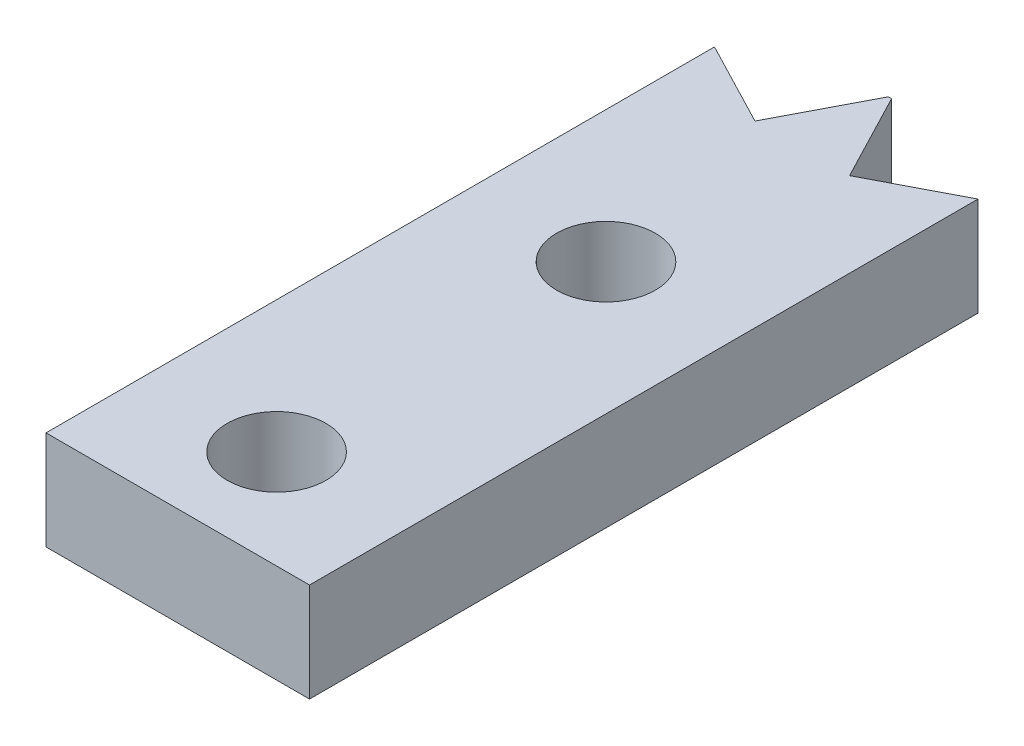
ISO-10303-21;
HEADER;
FILE_DESCRIPTION(('STEP AP214'),'2;1');
FILE_NAME('part.step','',(''),(''),'','','');
FILE_SCHEMA(('AUTOMOTIVE_DESIGN { 1 0 10303 214 1 1 1 1 }'));
ENDSEC;
DATA;
#1=APPLICATION_CONTEXT('core data for automotive mechanical design processes');
#2=APPLICATION_PROTOCOL_DEFINITION('international standard','automotive_design',2000,#1);
#3=PRODUCT_CONTEXT('',#1,'mechanical');
#4=PRODUCT('Part','Part','',(#3));
#5=PRODUCT_RELATED_PRODUCT_CATEGORY('part','',(#4));
#6=PRODUCT_DEFINITION_FORMATION('','',#4);
#7=PRODUCT_DEFINITION_CONTEXT('part definition',#1,'design');
#8=PRODUCT_DEFINITION('design','',#6,#7);
#9=PRODUCT_DEFINITION_SHAPE('','',#8);
#10=(LENGTH_UNIT() NAMED_UNIT(*) SI_UNIT(.MILLI.,.METRE.));
#11=(NAMED_UNIT(*) PLANE_ANGLE_UNIT() SI_UNIT($,.RADIAN.));
#12=(NAMED_UNIT(*) SI_UNIT($,.STERADIAN.) SOLID_ANGLE_UNIT());
#13=UNCERTAINTY_MEASURE_WITH_UNIT(LENGTH_MEASURE(1.E-05),#10,'distance_accuracy_value','');
#14=(GEOMETRIC_REPRESENTATION_CONTEXT(3) GLOBAL_UNCERTAINTY_ASSIGNED_CONTEXT((#13)) GLOBAL_UNIT_ASSIGNED_CONTEXT((#10,
#11,#12)) REPRESENTATION_CONTEXT('',''));
#15=CARTESIAN_POINT('',(0.,0.,0.));
#16=DIRECTION('',(0.,0.,1.));
#17=DIRECTION('',(1.,0.,0.));
#18=AXIS2_PLACEMENT_3D('',#15,#16,#17);
#19=CARTESIAN_POINT('',(0.,3.,0.));
#20=DIRECTION('',(0.,1.,0.));
#21=DIRECTION('',(0.,0.,1.));
#22=AXIS2_PLACEMENT_3D('',#19,#20,#21);
#23=PLANE('',#22);
#24=CARTESIAN_POINT('',(5.25372166076024,3.,-14.38));
#25=DIRECTION('',(0.,1.,0.));
#26=DIRECTION('',(0.,0.,1.));
#27=AXIS2_PLACEMENT_3D('',#24,#25,#26);
#28=CIRCLE('',#27,1.5);
#29=CARTESIAN_POINT('',(5.25372166076024,3.,-12.88));
#30=VERTEX_POINT('',#29);
#31=EDGE_CURVE('E115',#30,#30,#28,.T.);
#32=ORIENTED_EDGE('',*,*,#31,.F.);
#33=EDGE_LOOP('',(#32));
#34=FACE_BOUND('',#33,.T.);
#35=CARTESIAN_POINT('',(5.25372166076024,3.,-4.38));
#36=DIRECTION('',(0.,1.,0.));
#37=DIRECTION('',(0.,0.,1.));
#38=AXIS2_PLACEMENT_3D('',#35,#36,#37);
#39=CIRCLE('',#38,1.5);
#40=CARTESIAN_POINT('',(5.25372166076024,3.,-2.88));
#41=VERTEX_POINT('',#40);
#42=EDGE_CURVE('E145',#41,#41,#39,.T.);
#43=ORIENTED_EDGE('',*,*,#42,.F.);
#44=EDGE_LOOP('',(#43));
#45=FACE_BOUND('',#44,.T.);
#46=DIRECTION('',(0.,0.,-1.));
#47=VECTOR('',#46,1.);
#48=CARTESIAN_POINT('',(1.25372166076023,3.,0.));
#49=LINE('',#48,#47);
#50=CARTESIAN_POINT('',(1.25372166076023,3.,-1.38));
#51=VERTEX_POINT('',#50);
#52=CARTESIAN_POINT('',(1.25372166076023,3.,-21.6742955194717));
#53=VERTEX_POINT('',#52);
#54=EDGE_CURVE('E112',#51,#53,#49,.T.);
#55=ORIENTED_EDGE('',*,*,#54,.F.);
#56=DIRECTION('',(-1.,0.,0.));
#57=VECTOR('',#56,1.);
#58=CARTESIAN_POINT('',(1.25372166076023,3.,-1.38));
#59=LINE('',#58,#57);
#60=CARTESIAN_POINT('',(9.25372166076023,3.,-1.38));
#61=VERTEX_POINT('',#60);
#62=EDGE_CURVE('E49',#61,#51,#59,.T.);
#63=ORIENTED_EDGE('',*,*,#62,.F.);
#64=DIRECTION('',(0.,0.,1.));
#65=VECTOR('',#64,1.);
#66=CARTESIAN_POINT('',(9.25372166076023,3.,0.));
#67=LINE('',#66,#65);
#68=CARTESIAN_POINT('',(9.25372166076023,3.,-21.6742955194716));
#69=VERTEX_POINT('',#68);
#70=EDGE_CURVE('E185',#69,#61,#67,.T.);
#71=ORIENTED_EDGE('',*,*,#70,.F.);
#72=DIRECTION('',(-0.887010833178221,0.,0.461748613235035));
#73=VECTOR('',#72,1.);
#74=CARTESIAN_POINT('',(-6.90426925785102,3.,-13.2629778441283));
#75=LINE('',#74,#73);
#76=CARTESIAN_POINT('',(6.68896750046542,3.,-20.3391690108566));
#77=VERTEX_POINT('',#76);
#78=EDGE_CURVE('E166',#69,#77,#75,.T.);
#79=ORIENTED_EDGE('',*,*,#78,.T.);
#80=DIRECTION('',(0.461748613235035,0.,0.887010833178221));
#81=VECTOR('',#80,1.);
#82=CARTESIAN_POINT('',(13.5932367583164,3.,-7.07619116672839));
#83=LINE('',#82,#81);
#84=CARTESIAN_POINT('',(5.30372166076032,3.,-23.0002015103913));
#85=VERTEX_POINT('',#84);
#86=EDGE_CURVE('E139',#85,#77,#83,.T.);
#87=ORIENTED_EDGE('',*,*,#86,.F.);
#88=DIRECTION('',(1.,0.,0.));
#89=VECTOR('',#88,1.);
#90=CARTESIAN_POINT('',(0.,3.,-23.0002015103913));
#91=LINE('',#90,#89);
#92=CARTESIAN_POINT('',(5.20372166076032,3.,-23.0002015103913));
#93=VERTEX_POINT('',#92);
#94=EDGE_CURVE('E135',#93,#85,#91,.T.);
#95=ORIENTED_EDGE('',*,*,#94,.F.);
#96=DIRECTION('',(-0.461748613235035,0.,0.887010833178221));
#97=VECTOR('',#96,1.);
#98=CARTESIAN_POINT('',(-5.32610414979693,3.,-2.77259432819121));
#99=LINE('',#98,#97);
#100=CARTESIAN_POINT('',(3.81847582105521,3.,-20.3391690108567));
#101=VERTEX_POINT('',#100);
#102=EDGE_CURVE('E161',#93,#101,#99,.T.);
#103=ORIENTED_EDGE('',*,*,#102,.T.);
#104=DIRECTION('',(0.887010833178221,0.,0.461748613235035));
#105=VECTOR('',#104,1.);
#106=CARTESIAN_POINT('',(9.14457997085215,3.,-17.5665746826654));
#107=LINE('',#106,#105);
#108=EDGE_CURVE('E164',#53,#101,#107,.T.);
#109=ORIENTED_EDGE('',*,*,#108,.F.);
#110=EDGE_LOOP('',(#55,#63,#71,#79,#87,#95,#103,#109));
#111=FACE_BOUND('',#110,.T.);
#112=ADVANCED_FACE('F34',(#34,#45,#111),#23,.T.);
#113=CARTESIAN_POINT('',(0.,0.,0.));
#114=DIRECTION('',(0.,1.,0.));
#115=DIRECTION('',(0.,0.,1.));
#116=AXIS2_PLACEMENT_3D('',#113,#114,#115);
#117=PLANE('',#116);
#118=CARTESIAN_POINT('',(5.25372166076024,0.,-4.38));
#119=DIRECTION('',(0.,1.,0.));
#120=DIRECTION('',(0.,0.,1.));
#121=AXIS2_PLACEMENT_3D('',#118,#119,#120);
#122=CIRCLE('',#121,1.5);
#123=CARTESIAN_POINT('',(5.25372166076024,0.,-2.88));
#124=VERTEX_POINT('',#123);
#125=EDGE_CURVE('E149',#124,#124,#122,.T.);
#126=ORIENTED_EDGE('',*,*,#125,.T.);
#127=EDGE_LOOP('',(#126));
#128=FACE_BOUND('',#127,.T.);
#129=CARTESIAN_POINT('',(5.25372166076024,0.,-14.38));
#130=DIRECTION('',(0.,1.,0.));
#131=DIRECTION('',(0.,0.,1.));
#132=AXIS2_PLACEMENT_3D('',#129,#130,#131);
#133=CIRCLE('',#132,1.5);
#134=CARTESIAN_POINT('',(5.25372166076024,0.,-12.88));
#135=VERTEX_POINT('',#134);
#136=EDGE_CURVE('E143',#135,#135,#133,.T.);
#137=ORIENTED_EDGE('',*,*,#136,.T.);
#138=EDGE_LOOP('',(#137));
#139=FACE_BOUND('',#138,.T.);
#140=DIRECTION('',(1.,0.,0.));
#141=VECTOR('',#140,1.);
#142=CARTESIAN_POINT('',(1.25372166076023,0.,-1.38));
#143=LINE('',#142,#141);
#144=CARTESIAN_POINT('',(1.25372166076023,0.,-1.38));
#145=VERTEX_POINT('',#144);
#146=CARTESIAN_POINT('',(9.25372166076023,0.,-1.38));
#147=VERTEX_POINT('',#146);
#148=EDGE_CURVE('E97',#145,#147,#143,.T.);
#149=ORIENTED_EDGE('',*,*,#148,.F.);
#150=DIRECTION('',(0.,0.,-1.));
#151=VECTOR('',#150,1.);
#152=CARTESIAN_POINT('',(1.25372166076023,0.,0.));
#153=LINE('',#152,#151);
#154=CARTESIAN_POINT('',(1.25372166076023,0.,-21.6742955194717));
#155=VERTEX_POINT('',#154);
#156=EDGE_CURVE('E11',#145,#155,#153,.T.);
#157=ORIENTED_EDGE('',*,*,#156,.T.);
#158=DIRECTION('',(0.887010833178221,0.,0.461748613235035));
#159=VECTOR('',#158,1.);
#160=CARTESIAN_POINT('',(9.14457997085215,0.,-17.5665746826654));
#161=LINE('',#160,#159);
#162=CARTESIAN_POINT('',(3.81847582105521,0.,-20.3391690108567));
#163=VERTEX_POINT('',#162);
#164=EDGE_CURVE('E118',#155,#163,#161,.T.);
#165=ORIENTED_EDGE('',*,*,#164,.T.);
#166=DIRECTION('',(-0.461748613235035,0.,0.887010833178221));
#167=VECTOR('',#166,1.);
#168=CARTESIAN_POINT('',(-5.32610414979693,0.,-2.77259432819121));
#169=LINE('',#168,#167);
#170=CARTESIAN_POINT('',(5.20372166076032,0.,-23.0002015103913));
#171=VERTEX_POINT('',#170);
#172=EDGE_CURVE('E125',#171,#163,#169,.T.);
#173=ORIENTED_EDGE('',*,*,#172,.F.);
#174=DIRECTION('',(1.,0.,0.));
#175=VECTOR('',#174,1.);
#176=CARTESIAN_POINT('',(0.,0.,-23.0002015103913));
#177=LINE('',#176,#175);
#178=CARTESIAN_POINT('',(5.30372166076032,0.,-23.0002015103913));
#179=VERTEX_POINT('',#178);
#180=EDGE_CURVE('E129',#171,#179,#177,.T.);
#181=ORIENTED_EDGE('',*,*,#180,.T.);
#182=DIRECTION('',(0.461748613235035,0.,0.887010833178221));
#183=VECTOR('',#182,1.);
#184=CARTESIAN_POINT('',(13.5932367583164,0.,-7.07619116672839));
#185=LINE('',#184,#183);
#186=CARTESIAN_POINT('',(6.68896750046542,0.,-20.3391690108566));
#187=VERTEX_POINT('',#186);
#188=EDGE_CURVE('E127',#179,#187,#185,.T.);
#189=ORIENTED_EDGE('',*,*,#188,.T.);
#190=DIRECTION('',(-0.887010833178221,0.,0.461748613235035));
#191=VECTOR('',#190,1.);
#192=CARTESIAN_POINT('',(-6.90426925785102,0.,-13.2629778441283));
#193=LINE('',#192,#191);
#194=CARTESIAN_POINT('',(9.25372166076023,0.,-21.6742955194716));
#195=VERTEX_POINT('',#194);
#196=EDGE_CURVE('E124',#195,#187,#193,.T.);
#197=ORIENTED_EDGE('',*,*,#196,.F.);
#198=DIRECTION('',(0.,0.,-1.));
#199=VECTOR('',#198,1.);
#200=CARTESIAN_POINT('',(9.25372166076023,0.,0.));
#201=LINE('',#200,#199);
#202=EDGE_CURVE('E105',#147,#195,#201,.T.);
#203=ORIENTED_EDGE('',*,*,#202,.F.);
#204=EDGE_LOOP('',(#149,#157,#165,#173,#181,#189,#197,#203));
#205=FACE_BOUND('',#204,.T.);
#206=ADVANCED_FACE('F103',(#128,#139,#205),#117,.F.);
#207=CARTESIAN_POINT('',(9.25372166076023,10.,0.));
#208=DIRECTION('',(-1.,0.,0.));
#209=DIRECTION('',(0.,0.,1.));
#210=AXIS2_PLACEMENT_3D('',#207,#208,#209);
#211=PLANE('',#210);
#212=DIRECTION('',(0.,1.,0.));
#213=VECTOR('',#212,1.);
#214=CARTESIAN_POINT('',(9.25372166076023,3.,-1.38));
#215=LINE('',#214,#213);
#216=EDGE_CURVE('E106',#147,#61,#215,.T.);
#217=ORIENTED_EDGE('',*,*,#216,.F.);
#218=ORIENTED_EDGE('',*,*,#202,.T.);
#219=DIRECTION('',(0.,-1.,0.));
#220=VECTOR('',#219,1.);
#221=CARTESIAN_POINT('',(9.25372166076023,3.,-21.6742955194716));
#222=LINE('',#221,#220);
#223=EDGE_CURVE('E181',#69,#195,#222,.T.);
#224=ORIENTED_EDGE('',*,*,#223,.F.);
#225=ORIENTED_EDGE('',*,*,#70,.T.);
#226=EDGE_LOOP('',(#217,#218,#224,#225));
#227=FACE_BOUND('',#226,.T.);
#228=ADVANCED_FACE('F192',(#227),#211,.F.);
#229=CARTESIAN_POINT('',(1.25372166076023,10.,0.));
#230=DIRECTION('',(1.,0.,0.));
#231=DIRECTION('',(0.,0.,-1.));
#232=AXIS2_PLACEMENT_3D('',#229,#230,#231);
#233=PLANE('',#232);
#234=DIRECTION('',(0.,-1.,0.));
#235=VECTOR('',#234,1.);
#236=CARTESIAN_POINT('',(1.25372166076023,3.,-1.38));
#237=LINE('',#236,#235);
#238=EDGE_CURVE('E95',#51,#145,#237,.T.);
#239=ORIENTED_EDGE('',*,*,#238,.F.);
#240=ORIENTED_EDGE('',*,*,#54,.T.);
#241=DIRECTION('',(0.,-1.,0.));
#242=VECTOR('',#241,1.);
#243=CARTESIAN_POINT('',(1.25372166076023,3.,-21.6742955194717));
#244=LINE('',#243,#242);
#245=EDGE_CURVE('E110',#53,#155,#244,.T.);
#246=ORIENTED_EDGE('',*,*,#245,.T.);
#247=ORIENTED_EDGE('',*,*,#156,.F.);
#248=EDGE_LOOP('',(#239,#240,#246,#247));
#249=FACE_BOUND('',#248,.T.);
#250=ADVANCED_FACE('F108',(#249),#233,.F.);
#251=CARTESIAN_POINT('',(0.,3.,-23.0002015103913));
#252=DIRECTION('',(0.,0.,-1.));
#253=DIRECTION('',(-1.,0.,0.));
#254=AXIS2_PLACEMENT_3D('',#251,#252,#253);
#255=PLANE('',#254);
#256=ORIENTED_EDGE('',*,*,#180,.F.);
#257=DIRECTION('',(0.,-1.,0.));
#258=VECTOR('',#257,1.);
#259=CARTESIAN_POINT('',(5.20372166076032,3.,-23.0002015103913));
#260=LINE('',#259,#258);
#261=EDGE_CURVE('E42',#93,#171,#260,.T.);
#262=ORIENTED_EDGE('',*,*,#261,.F.);
#263=ORIENTED_EDGE('',*,*,#94,.T.);
#264=DIRECTION('',(0.,-1.,0.));
#265=VECTOR('',#264,1.);
#266=CARTESIAN_POINT('',(5.30372166076032,3.,-23.0002015103913));
#267=LINE('',#266,#265);
#268=EDGE_CURVE('E136',#85,#179,#267,.T.);
#269=ORIENTED_EDGE('',*,*,#268,.T.);
#270=EDGE_LOOP('',(#256,#262,#263,#269));
#271=FACE_BOUND('',#270,.T.);
#272=ADVANCED_FACE('F36',(#271),#255,.T.);
#273=CARTESIAN_POINT('',(-5.32610414979693,3.,-2.77259432819121));
#274=DIRECTION('',(0.887010833178221,0.,0.461748613235035));
#275=DIRECTION('',(0.461748613235035,0.,-0.887010833178221));
#276=AXIS2_PLACEMENT_3D('',#273,#274,#275);
#277=PLANE('',#276);
#278=ORIENTED_EDGE('',*,*,#172,.T.);
#279=DIRECTION('',(0.,-1.,0.));
#280=VECTOR('',#279,1.);
#281=CARTESIAN_POINT('',(3.81847582105521,3.,-20.3391690108567));
#282=LINE('',#281,#280);
#283=EDGE_CURVE('E121',#101,#163,#282,.T.);
#284=ORIENTED_EDGE('',*,*,#283,.F.);
#285=ORIENTED_EDGE('',*,*,#102,.F.);
#286=ORIENTED_EDGE('',*,*,#261,.T.);
#287=EDGE_LOOP('',(#278,#284,#285,#286));
#288=FACE_BOUND('',#287,.T.);
#289=ADVANCED_FACE('F217',(#288),#277,.F.);
#290=CARTESIAN_POINT('',(9.14457997085215,3.,-17.5665746826654));
#291=DIRECTION('',(0.461748613235035,0.,-0.887010833178221));
#292=DIRECTION('',(-0.887010833178221,0.,-0.461748613235035));
#293=AXIS2_PLACEMENT_3D('',#290,#291,#292);
#294=PLANE('',#293);
#295=ORIENTED_EDGE('',*,*,#245,.F.);
#296=ORIENTED_EDGE('',*,*,#108,.T.);
#297=ORIENTED_EDGE('',*,*,#283,.T.);
#298=ORIENTED_EDGE('',*,*,#164,.F.);
#299=EDGE_LOOP('',(#295,#296,#297,#298));
#300=FACE_BOUND('',#299,.T.);
#301=ADVANCED_FACE('F119',(#300),#294,.T.);
#302=CARTESIAN_POINT('',(-6.90426925785102,3.,-13.2629778441283));
#303=DIRECTION('',(0.461748613235035,0.,0.887010833178221));
#304=DIRECTION('',(0.887010833178221,0.,-0.461748613235035));
#305=AXIS2_PLACEMENT_3D('',#302,#303,#304);
#306=PLANE('',#305);
#307=ORIENTED_EDGE('',*,*,#78,.F.);
#308=ORIENTED_EDGE('',*,*,#223,.T.);
#309=ORIENTED_EDGE('',*,*,#196,.T.);
#310=DIRECTION('',(0.,-1.,0.));
#311=VECTOR('',#310,1.);
#312=CARTESIAN_POINT('',(6.68896750046542,3.,-20.3391690108566));
#313=LINE('',#312,#311);
#314=EDGE_CURVE('E138',#77,#187,#313,.T.);
#315=ORIENTED_EDGE('',*,*,#314,.F.);
#316=EDGE_LOOP('',(#307,#308,#309,#315));
#317=FACE_BOUND('',#316,.T.);
#318=ADVANCED_FACE('F179',(#317),#306,.F.);
#319=CARTESIAN_POINT('',(13.5932367583164,3.,-7.07619116672839));
#320=DIRECTION('',(0.887010833178221,0.,-0.461748613235035));
#321=DIRECTION('',(-0.461748613235035,0.,-0.887010833178221));
#322=AXIS2_PLACEMENT_3D('',#319,#320,#321);
#323=PLANE('',#322);
#324=ORIENTED_EDGE('',*,*,#188,.F.);
#325=ORIENTED_EDGE('',*,*,#268,.F.);
#326=ORIENTED_EDGE('',*,*,#86,.T.);
#327=ORIENTED_EDGE('',*,*,#314,.T.);
#328=EDGE_LOOP('',(#324,#325,#326,#327));
#329=FACE_BOUND('',#328,.T.);
#330=ADVANCED_FACE('F174',(#329),#323,.T.);
#331=CARTESIAN_POINT('',(5.25372166076024,3.,-4.38));
#332=DIRECTION('',(0.,1.,0.));
#333=DIRECTION('',(0.,0.,1.));
#334=AXIS2_PLACEMENT_3D('',#331,#332,#333);
#335=CYLINDRICAL_SURFACE('',#334,1.5);
#336=ORIENTED_EDGE('',*,*,#42,.T.);
#337=EDGE_LOOP('',(#336));
#338=FACE_BOUND('',#337,.T.);
#339=ORIENTED_EDGE('',*,*,#125,.F.);
#340=EDGE_LOOP('',(#339));
#341=FACE_BOUND('',#340,.T.);
#342=ADVANCED_FACE('F210',(#338,#341),#335,.F.);
#343=CARTESIAN_POINT('',(5.25372166076024,3.,-14.38));
#344=DIRECTION('',(0.,1.,0.));
#345=DIRECTION('',(0.,0.,1.));
#346=AXIS2_PLACEMENT_3D('',#343,#344,#345);
#347=CYLINDRICAL_SURFACE('',#346,1.5);
#348=ORIENTED_EDGE('',*,*,#31,.T.);
#349=EDGE_LOOP('',(#348));
#350=FACE_BOUND('',#349,.T.);
#351=ORIENTED_EDGE('',*,*,#136,.F.);
#352=EDGE_LOOP('',(#351));
#353=FACE_BOUND('',#352,.T.);
#354=ADVANCED_FACE('F243',(#350,#353),#347,.F.);
#355=CARTESIAN_POINT('',(0.,0.,-1.38));
#356=DIRECTION('',(0.,0.,1.));
#357=DIRECTION('',(1.,0.,0.));
#358=AXIS2_PLACEMENT_3D('',#355,#356,#357);
#359=PLANE('',#358);
#360=ORIENTED_EDGE('',*,*,#238,.T.);
#361=ORIENTED_EDGE('',*,*,#148,.T.);
#362=ORIENTED_EDGE('',*,*,#216,.T.);
#363=ORIENTED_EDGE('',*,*,#62,.T.);
#364=EDGE_LOOP('',(#360,#361,#362,#363));
#365=FACE_BOUND('',#364,.T.);
#366=ADVANCED_FACE('F96',(#365),#359,.T.);
#367=CLOSED_SHELL('',(#112,#206,#228,#250,#272,#289,#301,#318,#330,#342,#354,#366));
#368=MANIFOLD_SOLID_BREP('B2',#367);
#369=ADVANCED_BREP_SHAPE_REPRESENTATION('',(#18,#368),#14);
#370=SHAPE_DEFINITION_REPRESENTATION(#9,#369);
ENDSEC;
END-ISO-10303-21;
